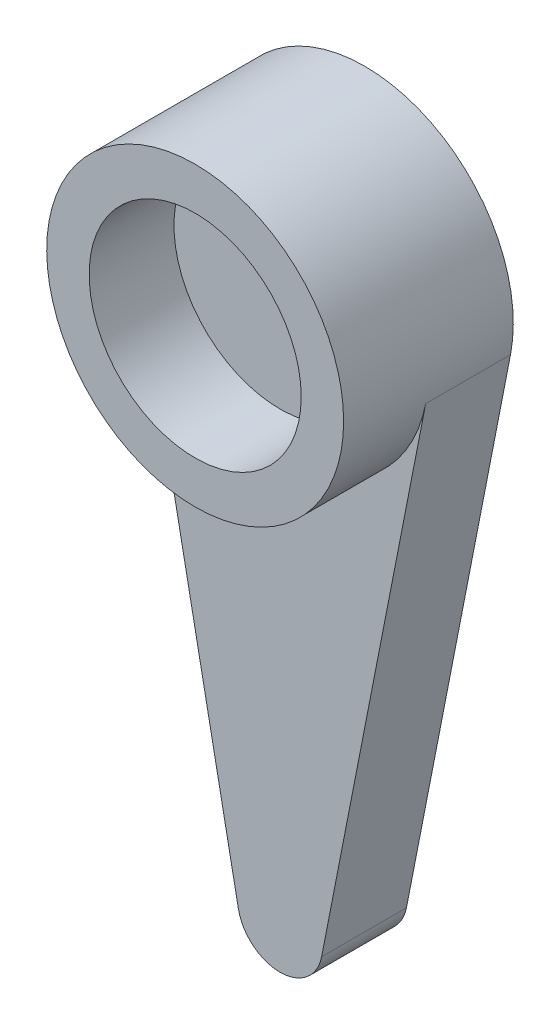
ISO-10303-21;
HEADER;
FILE_DESCRIPTION(('STEP AP214'),'2;1');
FILE_NAME('part.step','',(''),(''),'','','');
FILE_SCHEMA(('AUTOMOTIVE_DESIGN { 1 0 10303 214 1 1 1 1 }'));
ENDSEC;
DATA;
#1=APPLICATION_CONTEXT('core data for automotive mechanical design processes');
#2=APPLICATION_PROTOCOL_DEFINITION('international standard','automotive_design',2000,#1);
#3=PRODUCT_CONTEXT('',#1,'mechanical');
#4=PRODUCT('Part','Part','',(#3));
#5=PRODUCT_RELATED_PRODUCT_CATEGORY('part','',(#4));
#6=PRODUCT_DEFINITION_FORMATION('','',#4);
#7=PRODUCT_DEFINITION_CONTEXT('part definition',#1,'design');
#8=PRODUCT_DEFINITION('design','',#6,#7);
#9=PRODUCT_DEFINITION_SHAPE('','',#8);
#10=(LENGTH_UNIT() NAMED_UNIT(*) SI_UNIT(.MILLI.,.METRE.));
#11=(NAMED_UNIT(*) PLANE_ANGLE_UNIT() SI_UNIT($,.RADIAN.));
#12=(NAMED_UNIT(*) SI_UNIT($,.STERADIAN.) SOLID_ANGLE_UNIT());
#13=UNCERTAINTY_MEASURE_WITH_UNIT(LENGTH_MEASURE(1.E-05),#10,'distance_accuracy_value','');
#14=(GEOMETRIC_REPRESENTATION_CONTEXT(3) GLOBAL_UNCERTAINTY_ASSIGNED_CONTEXT((#13)) GLOBAL_UNIT_ASSIGNED_CONTEXT((#10,
#11,#12)) REPRESENTATION_CONTEXT('',''));
#15=CARTESIAN_POINT('',(0.,0.,0.));
#16=DIRECTION('',(0.,0.,1.));
#17=DIRECTION('',(1.,0.,0.));
#18=AXIS2_PLACEMENT_3D('',#15,#16,#17);
#19=CARTESIAN_POINT('',(0.9813346786287,-13.1923076923077,2.));
#20=DIRECTION('',(-0.981334678628698,0.192307692307692,0.));
#21=DIRECTION('',(-0.192307692307692,-0.981334678628698,0.));
#22=AXIS2_PLACEMENT_3D('',#19,#20,#21);
#23=PLANE('',#22);
#24=DIRECTION('',(0.192307692307692,0.981334678628698,0.));
#25=VECTOR('',#24,1.);
#26=CARTESIAN_POINT('',(0.9813346786287,-13.1923076923077,0.));
#27=LINE('',#26,#25);
#28=CARTESIAN_POINT('',(0.9813346786287,-13.1923076923077,0.));
#29=VERTEX_POINT('',#28);
#30=CARTESIAN_POINT('',(3.43467137520044,-0.673076923076923,0.));
#31=VERTEX_POINT('',#30);
#32=EDGE_CURVE('E107',#29,#31,#27,.T.);
#33=ORIENTED_EDGE('',*,*,#32,.T.);
#34=DIRECTION('',(0.,0.,-1.));
#35=VECTOR('',#34,1.);
#36=CARTESIAN_POINT('',(3.43467137520044,-0.673076923076923,2.));
#37=LINE('',#36,#35);
#38=CARTESIAN_POINT('',(3.43467137520044,-0.673076923076923,2.));
#39=VERTEX_POINT('',#38);
#40=EDGE_CURVE('E11',#39,#31,#37,.T.);
#41=ORIENTED_EDGE('',*,*,#40,.F.);
#42=DIRECTION('',(0.192307692307692,0.981334678628698,0.));
#43=VECTOR('',#42,1.);
#44=CARTESIAN_POINT('',(0.9813346786287,-13.1923076923077,2.));
#45=LINE('',#44,#43);
#46=CARTESIAN_POINT('',(0.9813346786287,-13.1923076923077,2.));
#47=VERTEX_POINT('',#46);
#48=EDGE_CURVE('E79',#47,#39,#45,.T.);
#49=ORIENTED_EDGE('',*,*,#48,.F.);
#50=DIRECTION('',(0.,0.,-1.));
#51=VECTOR('',#50,1.);
#52=CARTESIAN_POINT('',(0.9813346786287,-13.1923076923077,2.));
#53=LINE('',#52,#51);
#54=EDGE_CURVE('E118',#47,#29,#53,.T.);
#55=ORIENTED_EDGE('',*,*,#54,.T.);
#56=EDGE_LOOP('',(#33,#41,#49,#55));
#57=FACE_BOUND('',#56,.T.);
#58=ADVANCED_FACE('F39',(#57),#23,.F.);
#59=CARTESIAN_POINT('',(0.,0.,2.));
#60=DIRECTION('',(0.,0.,-1.));
#61=DIRECTION('',(-1.,0.,0.));
#62=AXIS2_PLACEMENT_3D('',#59,#60,#61);
#63=CYLINDRICAL_SURFACE('',#62,3.5);
#64=CARTESIAN_POINT('',(0.,0.,0.));
#65=DIRECTION('',(0.,0.,1.));
#66=DIRECTION('',(1.,0.,0.));
#67=AXIS2_PLACEMENT_3D('',#64,#65,#66);
#68=CIRCLE('',#67,3.5);
#69=CARTESIAN_POINT('',(-3.43467137520044,-0.673076923076922,0.));
#70=VERTEX_POINT('',#69);
#71=EDGE_CURVE('E96',#31,#70,#68,.T.);
#72=ORIENTED_EDGE('',*,*,#71,.T.);
#73=DIRECTION('',(0.,0.,-1.));
#74=VECTOR('',#73,1.);
#75=CARTESIAN_POINT('',(-3.43467137520044,-0.673076923076922,2.));
#76=LINE('',#75,#74);
#77=CARTESIAN_POINT('',(-3.43467137520044,-0.673076923076922,2.));
#78=VERTEX_POINT('',#77);
#79=EDGE_CURVE('E48',#78,#70,#76,.T.);
#80=ORIENTED_EDGE('',*,*,#79,.F.);
#81=CARTESIAN_POINT('',(0.,0.,2.));
#82=DIRECTION('',(0.,0.,1.));
#83=DIRECTION('',(1.,0.,0.));
#84=AXIS2_PLACEMENT_3D('',#81,#82,#83);
#85=CIRCLE('',#84,3.5);
#86=EDGE_CURVE('E95',#78,#39,#85,.T.);
#87=ORIENTED_EDGE('',*,*,#86,.T.);
#88=ORIENTED_EDGE('',*,*,#40,.T.);
#89=EDGE_LOOP('',(#72,#80,#87,#88));
#90=FACE_BOUND('',#89,.T.);
#91=CARTESIAN_POINT('',(0.,0.,4.));
#92=DIRECTION('',(0.,0.,1.));
#93=DIRECTION('',(1.,0.,0.));
#94=AXIS2_PLACEMENT_3D('',#91,#92,#93);
#95=CIRCLE('',#94,3.5);
#96=CARTESIAN_POINT('',(3.5,0.,4.));
#97=VERTEX_POINT('',#96);
#98=EDGE_CURVE('E101',#97,#97,#95,.T.);
#99=ORIENTED_EDGE('',*,*,#98,.F.);
#100=EDGE_LOOP('',(#99));
#101=FACE_BOUND('',#100,.T.);
#102=ADVANCED_FACE('F93',(#90,#101),#63,.T.);
#103=CARTESIAN_POINT('',(-0.981334678628697,-13.1923076923077,2.));
#104=DIRECTION('',(-0.981334678628698,-0.192307692307692,0.));
#105=DIRECTION('',(0.192307692307693,-0.981334678628698,0.));
#106=AXIS2_PLACEMENT_3D('',#103,#104,#105);
#107=PLANE('',#106);
#108=DIRECTION('',(-0.192307692307692,0.981334678628698,0.));
#109=VECTOR('',#108,1.);
#110=CARTESIAN_POINT('',(-0.981334678628697,-13.1923076923077,0.));
#111=LINE('',#110,#109);
#112=CARTESIAN_POINT('',(-0.981334678628697,-13.1923076923077,0.));
#113=VERTEX_POINT('',#112);
#114=EDGE_CURVE('E124',#113,#70,#111,.T.);
#115=ORIENTED_EDGE('',*,*,#114,.F.);
#116=DIRECTION('',(0.,0.,-1.));
#117=VECTOR('',#116,1.);
#118=CARTESIAN_POINT('',(-0.981334678628697,-13.1923076923077,2.));
#119=LINE('',#118,#117);
#120=CARTESIAN_POINT('',(-0.981334678628697,-13.1923076923077,2.));
#121=VERTEX_POINT('',#120);
#122=EDGE_CURVE('E73',#121,#113,#119,.T.);
#123=ORIENTED_EDGE('',*,*,#122,.F.);
#124=DIRECTION('',(-0.192307692307692,0.981334678628698,0.));
#125=VECTOR('',#124,1.);
#126=CARTESIAN_POINT('',(-0.981334678628697,-13.1923076923077,2.));
#127=LINE('',#126,#125);
#128=EDGE_CURVE('E84',#121,#78,#127,.T.);
#129=ORIENTED_EDGE('',*,*,#128,.T.);
#130=ORIENTED_EDGE('',*,*,#79,.T.);
#131=EDGE_LOOP('',(#115,#123,#129,#130));
#132=FACE_BOUND('',#131,.T.);
#133=ADVANCED_FACE('F87',(#132),#107,.T.);
#134=CARTESIAN_POINT('',(0.,-13.,2.));
#135=DIRECTION('',(0.,0.,-1.));
#136=DIRECTION('',(-1.,0.,0.));
#137=AXIS2_PLACEMENT_3D('',#134,#135,#136);
#138=CYLINDRICAL_SURFACE('',#137,1.);
#139=CARTESIAN_POINT('',(0.,-13.,0.));
#140=DIRECTION('',(0.,0.,1.));
#141=DIRECTION('',(1.,0.,0.));
#142=AXIS2_PLACEMENT_3D('',#139,#140,#141);
#143=CIRCLE('',#142,1.);
#144=EDGE_CURVE('E75',#113,#29,#143,.T.);
#145=ORIENTED_EDGE('',*,*,#144,.T.);
#146=ORIENTED_EDGE('',*,*,#54,.F.);
#147=CARTESIAN_POINT('',(0.,-13.,2.));
#148=DIRECTION('',(0.,0.,1.));
#149=DIRECTION('',(1.,0.,0.));
#150=AXIS2_PLACEMENT_3D('',#147,#148,#149);
#151=CIRCLE('',#150,1.);
#152=EDGE_CURVE('E56',#121,#47,#151,.T.);
#153=ORIENTED_EDGE('',*,*,#152,.F.);
#154=ORIENTED_EDGE('',*,*,#122,.T.);
#155=EDGE_LOOP('',(#145,#146,#153,#154));
#156=FACE_BOUND('',#155,.T.);
#157=ADVANCED_FACE('F146',(#156),#138,.T.);
#158=CARTESIAN_POINT('',(0.,0.,2.));
#159=DIRECTION('',(0.,0.,1.));
#160=DIRECTION('',(1.,0.,0.));
#161=AXIS2_PLACEMENT_3D('',#158,#159,#160);
#162=PLANE('',#161);
#163=ORIENTED_EDGE('',*,*,#86,.F.);
#164=ORIENTED_EDGE('',*,*,#128,.F.);
#165=ORIENTED_EDGE('',*,*,#152,.T.);
#166=ORIENTED_EDGE('',*,*,#48,.T.);
#167=EDGE_LOOP('',(#163,#164,#165,#166));
#168=FACE_BOUND('',#167,.T.);
#169=ADVANCED_FACE('F99',(#168),#162,.T.);
#170=CARTESIAN_POINT('',(0.,0.,0.));
#171=DIRECTION('',(0.,0.,1.));
#172=DIRECTION('',(1.,0.,0.));
#173=AXIS2_PLACEMENT_3D('',#170,#171,#172);
#174=PLANE('',#173);
#175=ORIENTED_EDGE('',*,*,#32,.F.);
#176=ORIENTED_EDGE('',*,*,#144,.F.);
#177=ORIENTED_EDGE('',*,*,#114,.T.);
#178=ORIENTED_EDGE('',*,*,#71,.F.);
#179=EDGE_LOOP('',(#175,#176,#177,#178));
#180=FACE_BOUND('',#179,.T.);
#181=ADVANCED_FACE('F135',(#180),#174,.F.);
#182=CARTESIAN_POINT('',(0.,0.,4.));
#183=DIRECTION('',(0.,0.,1.));
#184=DIRECTION('',(1.,0.,0.));
#185=AXIS2_PLACEMENT_3D('',#182,#183,#184);
#186=PLANE('',#185);
#187=ORIENTED_EDGE('',*,*,#98,.T.);
#188=EDGE_LOOP('',(#187));
#189=FACE_BOUND('',#188,.T.);
#190=CARTESIAN_POINT('',(0.,0.,4.));
#191=DIRECTION('',(0.,0.,1.));
#192=DIRECTION('',(1.,0.,0.));
#193=AXIS2_PLACEMENT_3D('',#190,#191,#192);
#194=CIRCLE('',#193,2.5);
#195=CARTESIAN_POINT('',(2.5,0.,4.));
#196=VERTEX_POINT('',#195);
#197=EDGE_CURVE('E102',#196,#196,#194,.T.);
#198=ORIENTED_EDGE('',*,*,#197,.F.);
#199=EDGE_LOOP('',(#198));
#200=FACE_BOUND('',#199,.T.);
#201=ADVANCED_FACE('F137',(#189,#200),#186,.T.);
#202=CARTESIAN_POINT('',(0.,0.,4.));
#203=DIRECTION('',(0.,0.,-1.));
#204=DIRECTION('',(-1.,0.,0.));
#205=AXIS2_PLACEMENT_3D('',#202,#203,#204);
#206=CYLINDRICAL_SURFACE('',#205,2.5);
#207=ORIENTED_EDGE('',*,*,#197,.T.);
#208=EDGE_LOOP('',(#207));
#209=FACE_BOUND('',#208,.T.);
#210=CARTESIAN_POINT('',(0.,0.,2.));
#211=DIRECTION('',(0.,0.,1.));
#212=DIRECTION('',(1.,0.,0.));
#213=AXIS2_PLACEMENT_3D('',#210,#211,#212);
#214=CIRCLE('',#213,2.5);
#215=CARTESIAN_POINT('',(2.5,0.,2.));
#216=VERTEX_POINT('',#215);
#217=EDGE_CURVE('E110',#216,#216,#214,.T.);
#218=ORIENTED_EDGE('',*,*,#217,.F.);
#219=EDGE_LOOP('',(#218));
#220=FACE_BOUND('',#219,.T.);
#221=ADVANCED_FACE('F143',(#209,#220),#206,.F.);
#222=ORIENTED_EDGE('',*,*,#217,.T.);
#223=EDGE_LOOP('',(#222));
#224=FACE_BOUND('',#223,.T.);
#225=ADVANCED_FACE('F148',(#224),#162,.T.);
#226=CLOSED_SHELL('',(#58,#102,#133,#157,#169,#181,#201,#221,#225));
#227=MANIFOLD_SOLID_BREP('B2',#226);
#228=ADVANCED_BREP_SHAPE_REPRESENTATION('',(#18,#227),#14);
#229=SHAPE_DEFINITION_REPRESENTATION(#9,#228);
ENDSEC;
END-ISO-10303-21;
